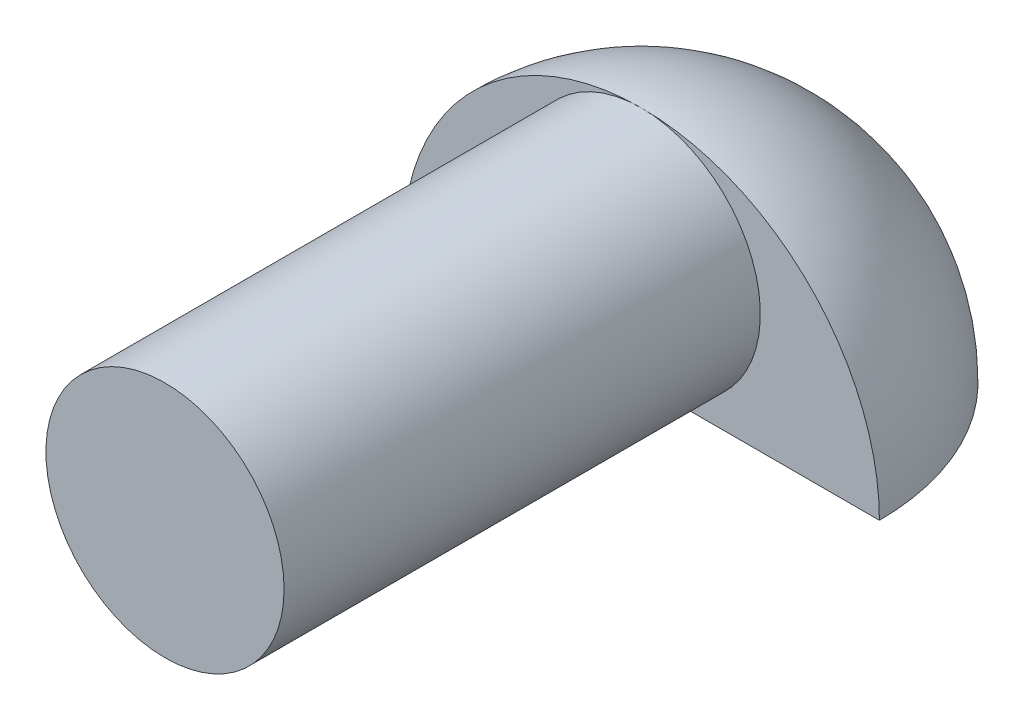
ISO-10303-21;
HEADER;
FILE_DESCRIPTION(('STEP AP214'),'2;1');
FILE_NAME('part.step','',(''),(''),'','','');
FILE_SCHEMA(('AUTOMOTIVE_DESIGN { 1 0 10303 214 1 1 1 1 }'));
ENDSEC;
DATA;
#1=APPLICATION_CONTEXT('core data for automotive mechanical design processes');
#2=APPLICATION_PROTOCOL_DEFINITION('international standard','automotive_design',2000,#1);
#3=PRODUCT_CONTEXT('',#1,'mechanical');
#4=PRODUCT('Part','Part','',(#3));
#5=PRODUCT_RELATED_PRODUCT_CATEGORY('part','',(#4));
#6=PRODUCT_DEFINITION_FORMATION('','',#4);
#7=PRODUCT_DEFINITION_CONTEXT('part definition',#1,'design');
#8=PRODUCT_DEFINITION('design','',#6,#7);
#9=PRODUCT_DEFINITION_SHAPE('','',#8);
#10=(LENGTH_UNIT() NAMED_UNIT(*) SI_UNIT(.MILLI.,.METRE.));
#11=(NAMED_UNIT(*) PLANE_ANGLE_UNIT() SI_UNIT($,.RADIAN.));
#12=(NAMED_UNIT(*) SI_UNIT($,.STERADIAN.) SOLID_ANGLE_UNIT());
#13=UNCERTAINTY_MEASURE_WITH_UNIT(LENGTH_MEASURE(1.E-05),#10,'distance_accuracy_value','');
#14=(GEOMETRIC_REPRESENTATION_CONTEXT(3) GLOBAL_UNCERTAINTY_ASSIGNED_CONTEXT((#13)) GLOBAL_UNIT_ASSIGNED_CONTEXT((#10,
#11,#12)) REPRESENTATION_CONTEXT('',''));
#15=CARTESIAN_POINT('',(0.,0.,0.));
#16=DIRECTION('',(0.,0.,1.));
#17=DIRECTION('',(1.,0.,0.));
#18=AXIS2_PLACEMENT_3D('',#15,#16,#17);
#19=CARTESIAN_POINT('',(0.,0.,0.));
#20=DIRECTION('',(0.,0.,-1.));
#21=DIRECTION('',(-1.,0.,0.));
#22=AXIS2_PLACEMENT_3D('',#19,#20,#21);
#23=PLANE('',#22);
#24=CARTESIAN_POINT('',(0.,9.525,0.));
#25=DIRECTION('',(0.,0.,-1.));
#26=DIRECTION('',(-1.,0.,0.));
#27=AXIS2_PLACEMENT_3D('',#24,#25,#26);
#28=CIRCLE('',#27,9.525);
#29=CARTESIAN_POINT('',(0.,0.,0.));
#30=VERTEX_POINT('',#29);
#31=CARTESIAN_POINT('',(0.,19.05,0.));
#32=VERTEX_POINT('',#31);
#33=EDGE_CURVE('E11',#30,#32,#28,.F.);
#34=ORIENTED_EDGE('',*,*,#33,.F.);
#35=DIRECTION('',(-1.,0.,0.));
#36=VECTOR('',#35,1.);
#37=CARTESIAN_POINT('',(19.05,0.,1.33025439009923E-13));
#38=LINE('',#37,#36);
#39=CARTESIAN_POINT('',(19.05,0.,1.33025439009923E-13));
#40=VERTEX_POINT('',#39);
#41=EDGE_CURVE('E75',#40,#30,#38,.T.);
#42=ORIENTED_EDGE('',*,*,#41,.F.);
#43=CARTESIAN_POINT('',(0.,0.,0.));
#44=DIRECTION('',(0.,0.,-1.));
#45=DIRECTION('',(-1.,0.,0.));
#46=AXIS2_PLACEMENT_3D('',#43,#44,#45);
#47=CIRCLE('',#46,19.05);
#48=EDGE_CURVE('E66',#32,#40,#47,.T.);
#49=ORIENTED_EDGE('',*,*,#48,.F.);
#50=EDGE_LOOP('',(#34,#42,#49));
#51=FACE_BOUND('',#50,.T.);
#52=ADVANCED_FACE('F43',(#51),#23,.F.);
#53=CARTESIAN_POINT('',(0.,0.,0.));
#54=DIRECTION('',(0.,1.,0.));
#55=DIRECTION('',(-1.,0.,0.));
#56=AXIS2_PLACEMENT_3D('',#53,#54,#55);
#57=SPHERICAL_SURFACE('',#56,19.05);
#58=CARTESIAN_POINT('',(0.,0.,0.));
#59=DIRECTION('',(0.,1.,0.));
#60=DIRECTION('',(-1.,0.,0.));
#61=AXIS2_PLACEMENT_3D('',#58,#59,#60);
#62=CIRCLE('',#61,19.05);
#63=CARTESIAN_POINT('',(-19.05,0.,0.));
#64=VERTEX_POINT('',#63);
#65=EDGE_CURVE('E52',#40,#64,#62,.T.);
#66=ORIENTED_EDGE('',*,*,#65,.T.);
#67=EDGE_CURVE('E83',#64,#32,#47,.T.);
#68=ORIENTED_EDGE('',*,*,#67,.T.);
#69=ORIENTED_EDGE('',*,*,#48,.T.);
#70=EDGE_LOOP('',(#66,#68,#69));
#71=FACE_BOUND('',#70,.T.);
#72=ADVANCED_FACE('F45',(#71),#57,.T.);
#73=CARTESIAN_POINT('',(19.05,0.,1.33025439009923E-13));
#74=DIRECTION('',(0.,-1.,0.));
#75=DIRECTION('',(1.,0.,0.));
#76=AXIS2_PLACEMENT_3D('',#73,#74,#75);
#77=PLANE('',#76);
#78=ORIENTED_EDGE('',*,*,#41,.T.);
#79=EDGE_CURVE('E77',#30,#64,#38,.T.);
#80=ORIENTED_EDGE('',*,*,#79,.T.);
#81=ORIENTED_EDGE('',*,*,#65,.F.);
#82=EDGE_LOOP('',(#78,#80,#81));
#83=FACE_BOUND('',#82,.T.);
#84=ADVANCED_FACE('F76',(#83),#77,.T.);
#85=CARTESIAN_POINT('',(0.,9.525,0.));
#86=DIRECTION('',(0.,0.,1.));
#87=DIRECTION('',(1.,0.,0.));
#88=AXIS2_PLACEMENT_3D('',#85,#86,#87);
#89=CIRCLE('',#88,9.525);
#90=EDGE_CURVE('E59',#32,#30,#89,.T.);
#91=ORIENTED_EDGE('',*,*,#90,.F.);
#92=ORIENTED_EDGE('',*,*,#67,.F.);
#93=ORIENTED_EDGE('',*,*,#79,.F.);
#94=EDGE_LOOP('',(#91,#92,#93));
#95=FACE_BOUND('',#94,.T.);
#96=ADVANCED_FACE('F82',(#95),#23,.F.);
#97=CARTESIAN_POINT('',(0.,9.525,38.1));
#98=DIRECTION('',(0.,0.,-1.));
#99=DIRECTION('',(-1.,0.,0.));
#100=AXIS2_PLACEMENT_3D('',#97,#98,#99);
#101=CYLINDRICAL_SURFACE('',#100,9.525);
#102=CARTESIAN_POINT('',(0.,9.525,38.1));
#103=DIRECTION('',(0.,0.,1.));
#104=DIRECTION('',(1.,0.,0.));
#105=AXIS2_PLACEMENT_3D('',#102,#103,#104);
#106=CIRCLE('',#105,9.525);
#107=CARTESIAN_POINT('',(9.525,9.525,38.1));
#108=VERTEX_POINT('',#107);
#109=EDGE_CURVE('E88',#108,#108,#106,.T.);
#110=ORIENTED_EDGE('',*,*,#109,.F.);
#111=EDGE_LOOP('',(#110));
#112=FACE_BOUND('',#111,.T.);
#113=ORIENTED_EDGE('',*,*,#90,.T.);
#114=ORIENTED_EDGE('',*,*,#33,.T.);
#115=EDGE_LOOP('',(#113,#114));
#116=FACE_BOUND('',#115,.T.);
#117=ADVANCED_FACE('F86',(#112,#116),#101,.T.);
#118=CARTESIAN_POINT('',(0.,9.525,38.1));
#119=DIRECTION('',(0.,0.,1.));
#120=DIRECTION('',(1.,0.,0.));
#121=AXIS2_PLACEMENT_3D('',#118,#119,#120);
#122=PLANE('',#121);
#123=ORIENTED_EDGE('',*,*,#109,.T.);
#124=EDGE_LOOP('',(#123));
#125=FACE_BOUND('',#124,.T.);
#126=ADVANCED_FACE('F109',(#125),#122,.T.);
#127=CLOSED_SHELL('',(#52,#72,#84,#96,#117,#126));
#128=MANIFOLD_SOLID_BREP('B2',#127);
#129=ADVANCED_BREP_SHAPE_REPRESENTATION('',(#18,#128),#14);
#130=SHAPE_DEFINITION_REPRESENTATION(#9,#129);
ENDSEC;
END-ISO-10303-21;
